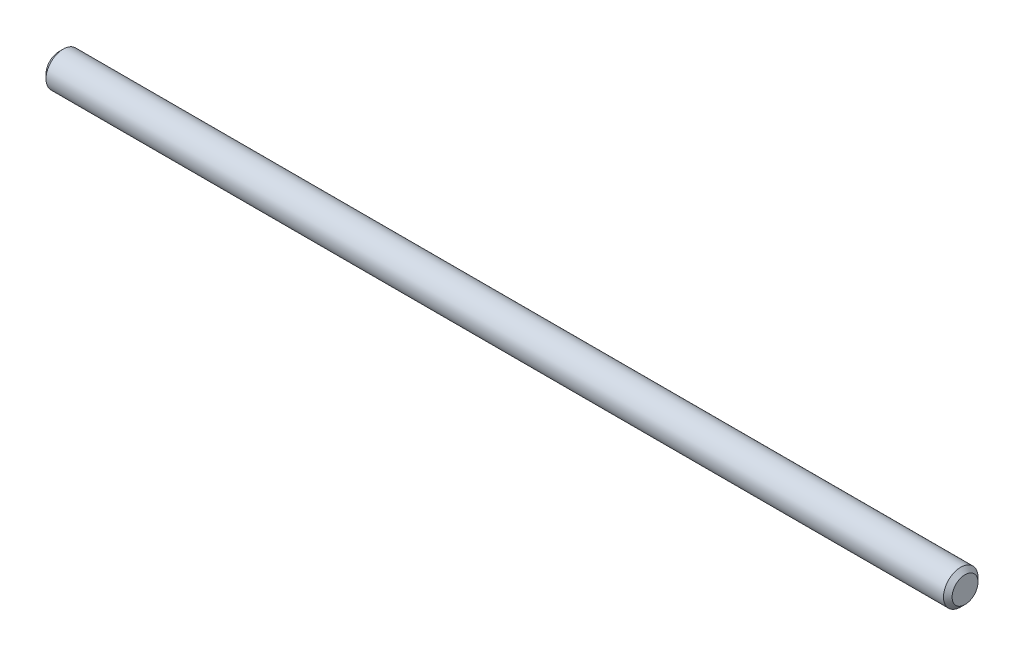
ISO-10303-21;
HEADER;
FILE_DESCRIPTION(('STEP AP214'),'2;1');
FILE_NAME('part.step','',(''),(''),'','','');
FILE_SCHEMA(('AUTOMOTIVE_DESIGN { 1 0 10303 214 1 1 1 1 }'));
ENDSEC;
DATA;
#1=APPLICATION_CONTEXT('core data for automotive mechanical design processes');
#2=APPLICATION_PROTOCOL_DEFINITION('international standard','automotive_design',2000,#1);
#3=PRODUCT_CONTEXT('',#1,'mechanical');
#4=PRODUCT('Part','Part','',(#3));
#5=PRODUCT_RELATED_PRODUCT_CATEGORY('part','',(#4));
#6=PRODUCT_DEFINITION_FORMATION('','',#4);
#7=PRODUCT_DEFINITION_CONTEXT('part definition',#1,'design');
#8=PRODUCT_DEFINITION('design','',#6,#7);
#9=PRODUCT_DEFINITION_SHAPE('','',#8);
#10=(LENGTH_UNIT() NAMED_UNIT(*) SI_UNIT(.MILLI.,.METRE.));
#11=(NAMED_UNIT(*) PLANE_ANGLE_UNIT() SI_UNIT($,.RADIAN.));
#12=(NAMED_UNIT(*) SI_UNIT($,.STERADIAN.) SOLID_ANGLE_UNIT());
#13=UNCERTAINTY_MEASURE_WITH_UNIT(LENGTH_MEASURE(1.E-05),#10,'distance_accuracy_value','');
#14=(GEOMETRIC_REPRESENTATION_CONTEXT(3) GLOBAL_UNCERTAINTY_ASSIGNED_CONTEXT((#13)) GLOBAL_UNIT_ASSIGNED_CONTEXT((#10,
#11,#12)) REPRESENTATION_CONTEXT('',''));
#15=CARTESIAN_POINT('',(0.,0.,0.));
#16=DIRECTION('',(0.,0.,1.));
#17=DIRECTION('',(1.,0.,0.));
#18=AXIS2_PLACEMENT_3D('',#15,#16,#17);
#19=CARTESIAN_POINT('',(52.5,0.,0.));
#20=DIRECTION('',(-1.,0.,0.));
#21=DIRECTION('',(0.,0.,1.));
#22=AXIS2_PLACEMENT_3D('',#19,#20,#21);
#23=CYLINDRICAL_SURFACE('',#22,2.);
#24=CARTESIAN_POINT('',(-52.,0.,0.));
#25=DIRECTION('',(1.,0.,0.));
#26=DIRECTION('',(0.,0.,-1.));
#27=AXIS2_PLACEMENT_3D('',#24,#25,#26);
#28=CIRCLE('',#27,2.);
#29=CARTESIAN_POINT('',(-52.,0.,-2.));
#30=VERTEX_POINT('',#29);
#31=EDGE_CURVE('E54',#30,#30,#28,.T.);
#32=ORIENTED_EDGE('',*,*,#31,.T.);
#33=EDGE_LOOP('',(#32));
#34=FACE_BOUND('',#33,.T.);
#35=CARTESIAN_POINT('',(52.,0.,0.));
#36=DIRECTION('',(1.,0.,0.));
#37=DIRECTION('',(0.,0.,-1.));
#38=AXIS2_PLACEMENT_3D('',#35,#36,#37);
#39=CIRCLE('',#38,2.);
#40=CARTESIAN_POINT('',(52.,0.,-2.));
#41=VERTEX_POINT('',#40);
#42=EDGE_CURVE('E59',#41,#41,#39,.F.);
#43=ORIENTED_EDGE('',*,*,#42,.T.);
#44=EDGE_LOOP('',(#43));
#45=FACE_BOUND('',#44,.T.);
#46=ADVANCED_FACE('F41',(#34,#45),#23,.T.);
#47=CARTESIAN_POINT('',(52.5,0.,0.));
#48=DIRECTION('',(1.,0.,0.));
#49=DIRECTION('',(0.,0.,-1.));
#50=AXIS2_PLACEMENT_3D('',#47,#48,#49);
#51=PLANE('',#50);
#52=CARTESIAN_POINT('',(52.5,0.,0.));
#53=DIRECTION('',(1.,0.,0.));
#54=DIRECTION('',(0.,0.,-1.));
#55=AXIS2_PLACEMENT_3D('',#52,#53,#54);
#56=CIRCLE('',#55,1.5);
#57=CARTESIAN_POINT('',(52.5,0.,-1.5));
#58=VERTEX_POINT('',#57);
#59=EDGE_CURVE('E10',#58,#58,#56,.T.);
#60=ORIENTED_EDGE('',*,*,#59,.T.);
#61=EDGE_LOOP('',(#60));
#62=FACE_BOUND('',#61,.T.);
#63=ADVANCED_FACE('F76',(#62),#51,.T.);
#64=CARTESIAN_POINT('',(-52.5,0.,0.));
#65=DIRECTION('',(1.,0.,0.));
#66=DIRECTION('',(0.,0.,-1.));
#67=AXIS2_PLACEMENT_3D('',#64,#65,#66);
#68=PLANE('',#67);
#69=CARTESIAN_POINT('',(-52.5,0.,0.));
#70=DIRECTION('',(1.,0.,0.));
#71=DIRECTION('',(0.,0.,-1.));
#72=AXIS2_PLACEMENT_3D('',#69,#70,#71);
#73=CIRCLE('',#72,1.5);
#74=CARTESIAN_POINT('',(-52.5,0.,-1.5));
#75=VERTEX_POINT('',#74);
#76=EDGE_CURVE('E49',#75,#75,#73,.F.);
#77=ORIENTED_EDGE('',*,*,#76,.T.);
#78=EDGE_LOOP('',(#77));
#79=FACE_BOUND('',#78,.T.);
#80=ADVANCED_FACE('F73',(#79),#68,.F.);
#81=CARTESIAN_POINT('',(-52.,0.,0.));
#82=DIRECTION('',(1.,0.,0.));
#83=DIRECTION('',(0.,0.,-1.));
#84=AXIS2_PLACEMENT_3D('',#81,#82,#83);
#85=CONICAL_SURFACE('',#84,2.,0.785398163397433);
#86=ORIENTED_EDGE('',*,*,#76,.F.);
#87=EDGE_LOOP('',(#86));
#88=FACE_BOUND('',#87,.T.);
#89=ORIENTED_EDGE('',*,*,#31,.F.);
#90=EDGE_LOOP('',(#89));
#91=FACE_BOUND('',#90,.T.);
#92=ADVANCED_FACE('F69',(#88,#91),#85,.T.);
#93=CARTESIAN_POINT('',(52.5,0.,0.));
#94=DIRECTION('',(-1.,0.,0.));
#95=DIRECTION('',(0.,0.,1.));
#96=AXIS2_PLACEMENT_3D('',#93,#94,#95);
#97=CONICAL_SURFACE('',#96,1.5,0.785398163397453);
#98=ORIENTED_EDGE('',*,*,#42,.F.);
#99=EDGE_LOOP('',(#98));
#100=FACE_BOUND('',#99,.T.);
#101=ORIENTED_EDGE('',*,*,#59,.F.);
#102=EDGE_LOOP('',(#101));
#103=FACE_BOUND('',#102,.T.);
#104=ADVANCED_FACE('F43',(#100,#103),#97,.T.);
#105=CLOSED_SHELL('',(#46,#63,#80,#92,#104));
#106=MANIFOLD_SOLID_BREP('B2',#105);
#107=ADVANCED_BREP_SHAPE_REPRESENTATION('',(#18,#106),#14);
#108=SHAPE_DEFINITION_REPRESENTATION(#9,#107);
ENDSEC;
END-ISO-10303-21;
